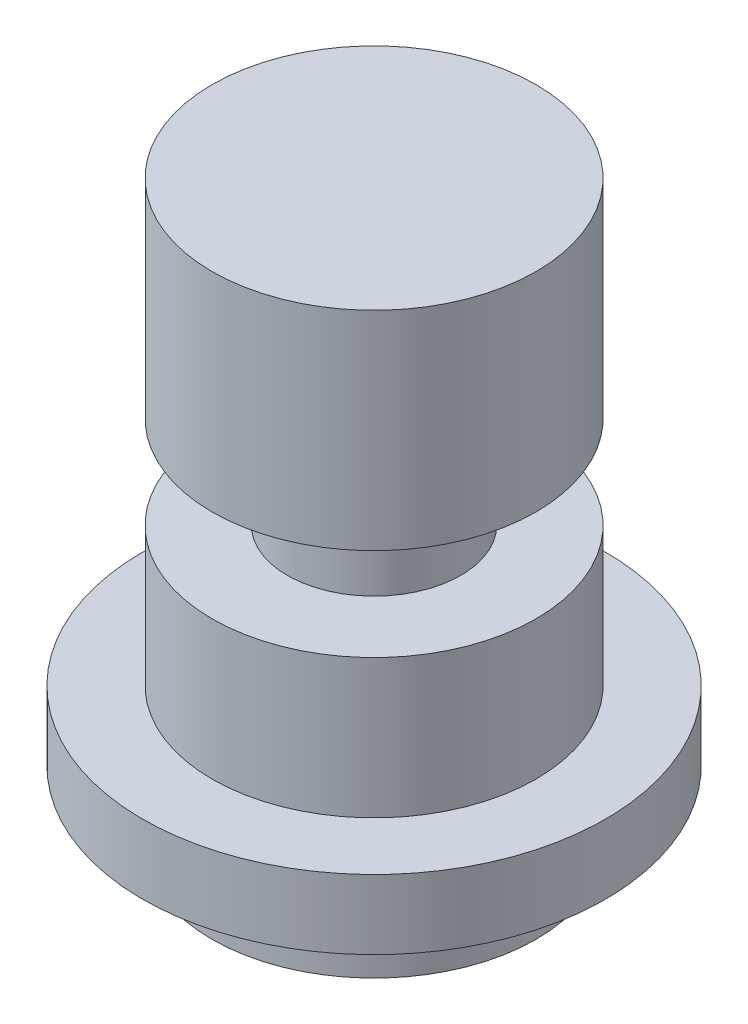
ISO-10303-21;
HEADER;
FILE_DESCRIPTION(('STEP AP214'),'2;1');
FILE_NAME('part.step','',(''),(''),'','','');
FILE_SCHEMA(('AUTOMOTIVE_DESIGN { 1 0 10303 214 1 1 1 1 }'));
ENDSEC;
DATA;
#1=APPLICATION_CONTEXT('core data for automotive mechanical design processes');
#2=APPLICATION_PROTOCOL_DEFINITION('international standard','automotive_design',2000,#1);
#3=PRODUCT_CONTEXT('',#1,'mechanical');
#4=PRODUCT('Part','Part','',(#3));
#5=PRODUCT_RELATED_PRODUCT_CATEGORY('part','',(#4));
#6=PRODUCT_DEFINITION_FORMATION('','',#4);
#7=PRODUCT_DEFINITION_CONTEXT('part definition',#1,'design');
#8=PRODUCT_DEFINITION('design','',#6,#7);
#9=PRODUCT_DEFINITION_SHAPE('','',#8);
#10=(LENGTH_UNIT() NAMED_UNIT(*) SI_UNIT(.MILLI.,.METRE.));
#11=(NAMED_UNIT(*) PLANE_ANGLE_UNIT() SI_UNIT($,.RADIAN.));
#12=(NAMED_UNIT(*) SI_UNIT($,.STERADIAN.) SOLID_ANGLE_UNIT());
#13=UNCERTAINTY_MEASURE_WITH_UNIT(LENGTH_MEASURE(1.E-05),#10,'distance_accuracy_value','');
#14=(GEOMETRIC_REPRESENTATION_CONTEXT(3) GLOBAL_UNCERTAINTY_ASSIGNED_CONTEXT((#13)) GLOBAL_UNIT_ASSIGNED_CONTEXT((#10,
#11,#12)) REPRESENTATION_CONTEXT('',''));
#15=CARTESIAN_POINT('',(0.,0.,0.));
#16=DIRECTION('',(0.,0.,1.));
#17=DIRECTION('',(1.,0.,0.));
#18=AXIS2_PLACEMENT_3D('',#15,#16,#17);
#19=CARTESIAN_POINT('',(0.,0.,0.));
#20=DIRECTION('',(0.,-1.,0.));
#21=DIRECTION('',(1.,0.,0.));
#22=AXIS2_PLACEMENT_3D('',#19,#20,#21);
#23=PLANE('',#22);
#24=CARTESIAN_POINT('',(0.,0.,0.));
#25=DIRECTION('',(0.,1.,0.));
#26=DIRECTION('',(-1.,0.,0.));
#27=AXIS2_PLACEMENT_3D('',#24,#25,#26);
#28=CIRCLE('',#27,7.);
#29=CARTESIAN_POINT('',(-7.,0.,0.));
#30=VERTEX_POINT('',#29);
#31=EDGE_CURVE('E10',#30,#30,#28,.T.);
#32=ORIENTED_EDGE('',*,*,#31,.F.);
#33=EDGE_LOOP('',(#32));
#34=FACE_BOUND('',#33,.T.);
#35=ADVANCED_FACE('F35',(#34),#23,.T.);
#36=CARTESIAN_POINT('',(0.,25.,0.));
#37=DIRECTION('',(0.,1.,0.));
#38=DIRECTION('',(-1.,0.,0.));
#39=AXIS2_PLACEMENT_3D('',#36,#37,#38);
#40=CYLINDRICAL_SURFACE('',#39,7.);
#41=ORIENTED_EDGE('',*,*,#31,.T.);
#42=EDGE_LOOP('',(#41));
#43=FACE_BOUND('',#42,.T.);
#44=CARTESIAN_POINT('',(0.,3.,0.));
#45=DIRECTION('',(0.,1.,0.));
#46=DIRECTION('',(-1.,0.,0.));
#47=AXIS2_PLACEMENT_3D('',#44,#45,#46);
#48=CIRCLE('',#47,7.);
#49=CARTESIAN_POINT('',(-7.,3.,0.));
#50=VERTEX_POINT('',#49);
#51=EDGE_CURVE('E41',#50,#50,#48,.T.);
#52=ORIENTED_EDGE('',*,*,#51,.F.);
#53=EDGE_LOOP('',(#52));
#54=FACE_BOUND('',#53,.T.);
#55=ADVANCED_FACE('F89',(#43,#54),#40,.T.);
#56=CARTESIAN_POINT('',(-7.,3.,0.));
#57=DIRECTION('',(0.,-1.,0.));
#58=DIRECTION('',(1.,0.,0.));
#59=AXIS2_PLACEMENT_3D('',#56,#57,#58);
#60=PLANE('',#59);
#61=ORIENTED_EDGE('',*,*,#51,.T.);
#62=EDGE_LOOP('',(#61));
#63=FACE_BOUND('',#62,.T.);
#64=CARTESIAN_POINT('',(0.,3.,0.));
#65=DIRECTION('',(0.,1.,0.));
#66=DIRECTION('',(-1.,0.,0.));
#67=AXIS2_PLACEMENT_3D('',#64,#65,#66);
#68=CIRCLE('',#67,10.);
#69=CARTESIAN_POINT('',(-10.,3.,0.));
#70=VERTEX_POINT('',#69);
#71=EDGE_CURVE('E45',#70,#70,#68,.T.);
#72=ORIENTED_EDGE('',*,*,#71,.F.);
#73=EDGE_LOOP('',(#72));
#74=FACE_BOUND('',#73,.T.);
#75=ADVANCED_FACE('F94',(#63,#74),#60,.T.);
#76=CARTESIAN_POINT('',(0.,25.,0.));
#77=DIRECTION('',(0.,1.,0.));
#78=DIRECTION('',(-1.,0.,0.));
#79=AXIS2_PLACEMENT_3D('',#76,#77,#78);
#80=CYLINDRICAL_SURFACE('',#79,10.);
#81=ORIENTED_EDGE('',*,*,#71,.T.);
#82=EDGE_LOOP('',(#81));
#83=FACE_BOUND('',#82,.T.);
#84=CARTESIAN_POINT('',(0.,6.,0.));
#85=DIRECTION('',(0.,1.,0.));
#86=DIRECTION('',(-1.,0.,0.));
#87=AXIS2_PLACEMENT_3D('',#84,#85,#86);
#88=CIRCLE('',#87,10.);
#89=CARTESIAN_POINT('',(-10.,6.,0.));
#90=VERTEX_POINT('',#89);
#91=EDGE_CURVE('E49',#90,#90,#88,.T.);
#92=ORIENTED_EDGE('',*,*,#91,.F.);
#93=EDGE_LOOP('',(#92));
#94=FACE_BOUND('',#93,.T.);
#95=ADVANCED_FACE('F98',(#83,#94),#80,.T.);
#96=CARTESIAN_POINT('',(-10.,6.,0.));
#97=DIRECTION('',(0.,1.,0.));
#98=DIRECTION('',(-1.,0.,0.));
#99=AXIS2_PLACEMENT_3D('',#96,#97,#98);
#100=PLANE('',#99);
#101=ORIENTED_EDGE('',*,*,#91,.T.);
#102=EDGE_LOOP('',(#101));
#103=FACE_BOUND('',#102,.T.);
#104=CARTESIAN_POINT('',(0.,6.,0.));
#105=DIRECTION('',(0.,1.,0.));
#106=DIRECTION('',(-1.,0.,0.));
#107=AXIS2_PLACEMENT_3D('',#104,#105,#106);
#108=CIRCLE('',#107,7.);
#109=CARTESIAN_POINT('',(-7.,6.,0.));
#110=VERTEX_POINT('',#109);
#111=EDGE_CURVE('E54',#110,#110,#108,.T.);
#112=ORIENTED_EDGE('',*,*,#111,.F.);
#113=EDGE_LOOP('',(#112));
#114=FACE_BOUND('',#113,.T.);
#115=ADVANCED_FACE('F104',(#103,#114),#100,.T.);
#116=CARTESIAN_POINT('',(0.,25.,0.));
#117=DIRECTION('',(0.,1.,0.));
#118=DIRECTION('',(-1.,0.,0.));
#119=AXIS2_PLACEMENT_3D('',#116,#117,#118);
#120=CYLINDRICAL_SURFACE('',#119,7.);
#121=ORIENTED_EDGE('',*,*,#111,.T.);
#122=EDGE_LOOP('',(#121));
#123=FACE_BOUND('',#122,.T.);
#124=CARTESIAN_POINT('',(0.,12.,0.));
#125=DIRECTION('',(0.,1.,0.));
#126=DIRECTION('',(-1.,0.,0.));
#127=AXIS2_PLACEMENT_3D('',#124,#125,#126);
#128=CIRCLE('',#127,7.);
#129=CARTESIAN_POINT('',(-7.,12.,0.));
#130=VERTEX_POINT('',#129);
#131=EDGE_CURVE('E57',#130,#130,#128,.T.);
#132=ORIENTED_EDGE('',*,*,#131,.F.);
#133=EDGE_LOOP('',(#132));
#134=FACE_BOUND('',#133,.T.);
#135=ADVANCED_FACE('F108',(#123,#134),#120,.T.);
#136=CARTESIAN_POINT('',(-7.,12.,0.));
#137=DIRECTION('',(0.,1.,0.));
#138=DIRECTION('',(-1.,0.,0.));
#139=AXIS2_PLACEMENT_3D('',#136,#137,#138);
#140=PLANE('',#139);
#141=ORIENTED_EDGE('',*,*,#131,.T.);
#142=EDGE_LOOP('',(#141));
#143=FACE_BOUND('',#142,.T.);
#144=CARTESIAN_POINT('',(0.,12.,0.));
#145=DIRECTION('',(0.,1.,0.));
#146=DIRECTION('',(-1.,0.,0.));
#147=AXIS2_PLACEMENT_3D('',#144,#145,#146);
#148=CIRCLE('',#147,3.74999999999999);
#149=CARTESIAN_POINT('',(-3.74999999999999,12.,0.));
#150=VERTEX_POINT('',#149);
#151=EDGE_CURVE('E60',#150,#150,#148,.T.);
#152=ORIENTED_EDGE('',*,*,#151,.F.);
#153=EDGE_LOOP('',(#152));
#154=FACE_BOUND('',#153,.T.);
#155=ADVANCED_FACE('F112',(#143,#154),#140,.T.);
#156=CARTESIAN_POINT('',(0.,25.,0.));
#157=DIRECTION('',(0.,1.,0.));
#158=DIRECTION('',(-1.,0.,0.));
#159=AXIS2_PLACEMENT_3D('',#156,#157,#158);
#160=CYLINDRICAL_SURFACE('',#159,3.74999999999999);
#161=ORIENTED_EDGE('',*,*,#151,.T.);
#162=EDGE_LOOP('',(#161));
#163=FACE_BOUND('',#162,.T.);
#164=CARTESIAN_POINT('',(0.,16.,0.));
#165=DIRECTION('',(0.,1.,0.));
#166=DIRECTION('',(-1.,0.,0.));
#167=AXIS2_PLACEMENT_3D('',#164,#165,#166);
#168=CIRCLE('',#167,3.74999999999999);
#169=CARTESIAN_POINT('',(-3.74999999999999,16.,0.));
#170=VERTEX_POINT('',#169);
#171=EDGE_CURVE('E63',#170,#170,#168,.T.);
#172=ORIENTED_EDGE('',*,*,#171,.F.);
#173=EDGE_LOOP('',(#172));
#174=FACE_BOUND('',#173,.T.);
#175=ADVANCED_FACE('F85',(#163,#174),#160,.T.);
#176=CARTESIAN_POINT('',(-3.74999999999999,16.,0.));
#177=DIRECTION('',(0.,-1.,0.));
#178=DIRECTION('',(1.,0.,0.));
#179=AXIS2_PLACEMENT_3D('',#176,#177,#178);
#180=PLANE('',#179);
#181=ORIENTED_EDGE('',*,*,#171,.T.);
#182=EDGE_LOOP('',(#181));
#183=FACE_BOUND('',#182,.T.);
#184=CARTESIAN_POINT('',(0.,16.,0.));
#185=DIRECTION('',(0.,1.,0.));
#186=DIRECTION('',(-1.,0.,0.));
#187=AXIS2_PLACEMENT_3D('',#184,#185,#186);
#188=CIRCLE('',#187,7.);
#189=CARTESIAN_POINT('',(-7.,16.,0.));
#190=VERTEX_POINT('',#189);
#191=EDGE_CURVE('E66',#190,#190,#188,.T.);
#192=ORIENTED_EDGE('',*,*,#191,.F.);
#193=EDGE_LOOP('',(#192));
#194=FACE_BOUND('',#193,.T.);
#195=ADVANCED_FACE('F77',(#183,#194),#180,.T.);
#196=CARTESIAN_POINT('',(0.,25.,0.));
#197=DIRECTION('',(0.,1.,0.));
#198=DIRECTION('',(-1.,0.,0.));
#199=AXIS2_PLACEMENT_3D('',#196,#197,#198);
#200=CYLINDRICAL_SURFACE('',#199,7.);
#201=ORIENTED_EDGE('',*,*,#191,.T.);
#202=EDGE_LOOP('',(#201));
#203=FACE_BOUND('',#202,.T.);
#204=CARTESIAN_POINT('',(0.,25.,0.));
#205=DIRECTION('',(0.,1.,0.));
#206=DIRECTION('',(-1.,0.,0.));
#207=AXIS2_PLACEMENT_3D('',#204,#205,#206);
#208=CIRCLE('',#207,7.);
#209=CARTESIAN_POINT('',(-7.,25.,0.));
#210=VERTEX_POINT('',#209);
#211=EDGE_CURVE('E69',#210,#210,#208,.T.);
#212=ORIENTED_EDGE('',*,*,#211,.F.);
#213=EDGE_LOOP('',(#212));
#214=FACE_BOUND('',#213,.T.);
#215=ADVANCED_FACE('F75',(#203,#214),#200,.T.);
#216=CARTESIAN_POINT('',(-7.,25.,0.));
#217=DIRECTION('',(0.,1.,0.));
#218=DIRECTION('',(-1.,0.,0.));
#219=AXIS2_PLACEMENT_3D('',#216,#217,#218);
#220=PLANE('',#219);
#221=ORIENTED_EDGE('',*,*,#211,.T.);
#222=EDGE_LOOP('',(#221));
#223=FACE_BOUND('',#222,.T.);
#224=ADVANCED_FACE('F73',(#223),#220,.T.);
#225=CLOSED_SHELL('',(#35,#55,#75,#95,#115,#135,#155,#175,#195,#215,#224));
#226=MANIFOLD_SOLID_BREP('B2',#225);
#227=ADVANCED_BREP_SHAPE_REPRESENTATION('',(#18,#226),#14);
#228=SHAPE_DEFINITION_REPRESENTATION(#9,#227);
ENDSEC;
END-ISO-10303-21;
